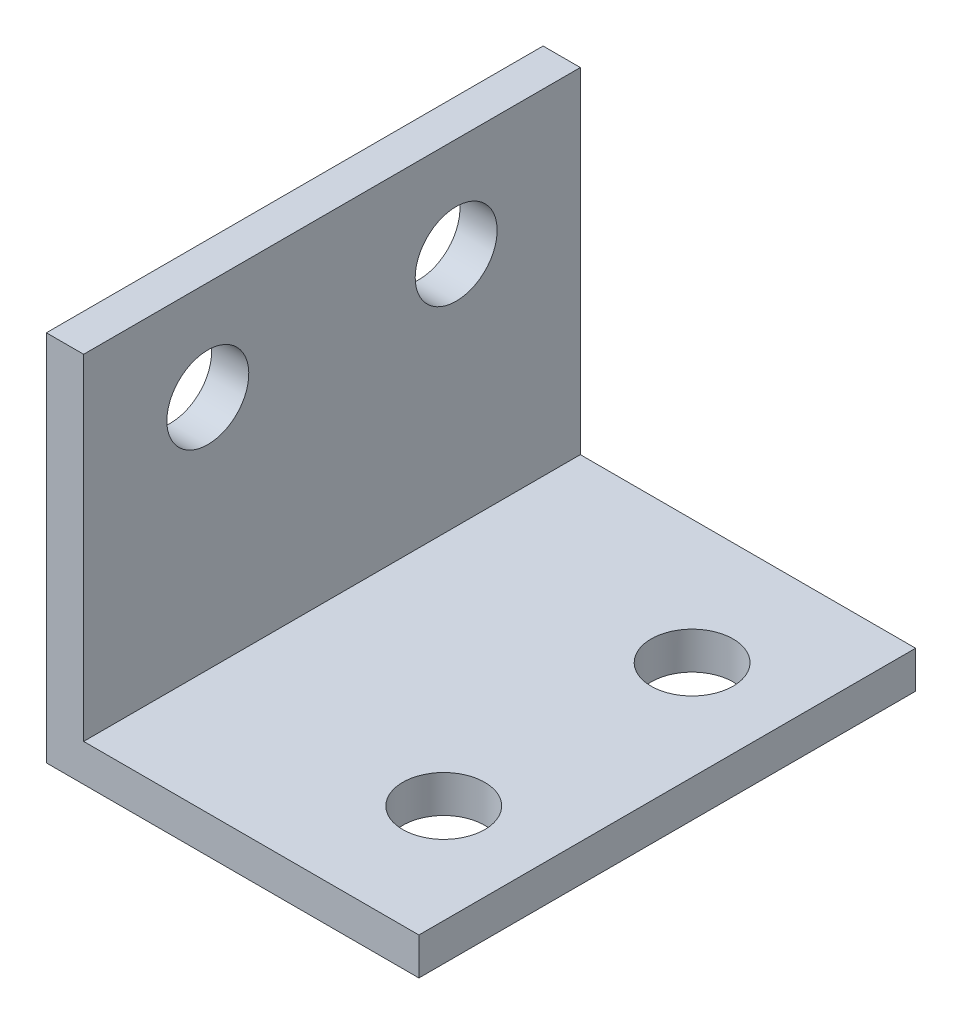
ISO-10303-21;
HEADER;
FILE_DESCRIPTION(('STEP AP214'),'2;1');
FILE_NAME('part.step','',(''),(''),'','','');
FILE_SCHEMA(('AUTOMOTIVE_DESIGN { 1 0 10303 214 1 1 1 1 }'));
ENDSEC;
DATA;
#1=APPLICATION_CONTEXT('core data for automotive mechanical design processes');
#2=APPLICATION_PROTOCOL_DEFINITION('international standard','automotive_design',2000,#1);
#3=PRODUCT_CONTEXT('',#1,'mechanical');
#4=PRODUCT('Part','Part','',(#3));
#5=PRODUCT_RELATED_PRODUCT_CATEGORY('part','',(#4));
#6=PRODUCT_DEFINITION_FORMATION('','',#4);
#7=PRODUCT_DEFINITION_CONTEXT('part definition',#1,'design');
#8=PRODUCT_DEFINITION('design','',#6,#7);
#9=PRODUCT_DEFINITION_SHAPE('','',#8);
#10=(LENGTH_UNIT() NAMED_UNIT(*) SI_UNIT(.MILLI.,.METRE.));
#11=(NAMED_UNIT(*) PLANE_ANGLE_UNIT() SI_UNIT($,.RADIAN.));
#12=(NAMED_UNIT(*) SI_UNIT($,.STERADIAN.) SOLID_ANGLE_UNIT());
#13=UNCERTAINTY_MEASURE_WITH_UNIT(LENGTH_MEASURE(1.E-05),#10,'distance_accuracy_value','');
#14=(GEOMETRIC_REPRESENTATION_CONTEXT(3) GLOBAL_UNCERTAINTY_ASSIGNED_CONTEXT((#13)) GLOBAL_UNIT_ASSIGNED_CONTEXT((#10,
#11,#12)) REPRESENTATION_CONTEXT('',''));
#15=CARTESIAN_POINT('',(0.,0.,0.));
#16=DIRECTION('',(0.,0.,1.));
#17=DIRECTION('',(1.,0.,0.));
#18=AXIS2_PLACEMENT_3D('',#15,#16,#17);
#19=CARTESIAN_POINT('',(30.,0.,40.));
#20=DIRECTION('',(0.,1.,0.));
#21=DIRECTION('',(-1.,0.,0.));
#22=AXIS2_PLACEMENT_3D('',#19,#20,#21);
#23=PLANE('',#22);
#24=CARTESIAN_POINT('',(22.,0.,10.));
#25=DIRECTION('',(0.,-1.,0.));
#26=DIRECTION('',(-1.,0.,0.));
#27=AXIS2_PLACEMENT_3D('',#24,#25,#26);
#28=CIRCLE('',#27,3.3);
#29=CARTESIAN_POINT('',(18.7,0.,10.));
#30=VERTEX_POINT('',#29);
#31=EDGE_CURVE('E150',#30,#30,#28,.T.);
#32=ORIENTED_EDGE('',*,*,#31,.F.);
#33=EDGE_LOOP('',(#32));
#34=FACE_BOUND('',#33,.T.);
#35=CARTESIAN_POINT('',(22.,0.,30.));
#36=DIRECTION('',(0.,-1.,0.));
#37=DIRECTION('',(1.,0.,0.));
#38=AXIS2_PLACEMENT_3D('',#35,#36,#37);
#39=CIRCLE('',#38,3.3);
#40=CARTESIAN_POINT('',(25.3,0.,30.));
#41=VERTEX_POINT('',#40);
#42=EDGE_CURVE('E139',#41,#41,#39,.T.);
#43=ORIENTED_EDGE('',*,*,#42,.F.);
#44=EDGE_LOOP('',(#43));
#45=FACE_BOUND('',#44,.T.);
#46=DIRECTION('',(1.,0.,0.));
#47=VECTOR('',#46,1.);
#48=CARTESIAN_POINT('',(30.,0.,0.));
#49=LINE('',#48,#47);
#50=CARTESIAN_POINT('',(0.,0.,0.));
#51=VERTEX_POINT('',#50);
#52=CARTESIAN_POINT('',(30.,0.,0.));
#53=VERTEX_POINT('',#52);
#54=EDGE_CURVE('E120',#51,#53,#49,.T.);
#55=ORIENTED_EDGE('',*,*,#54,.T.);
#56=DIRECTION('',(0.,0.,-1.));
#57=VECTOR('',#56,1.);
#58=CARTESIAN_POINT('',(30.,0.,40.));
#59=LINE('',#58,#57);
#60=CARTESIAN_POINT('',(30.,0.,40.));
#61=VERTEX_POINT('',#60);
#62=EDGE_CURVE('E11',#61,#53,#59,.T.);
#63=ORIENTED_EDGE('',*,*,#62,.F.);
#64=DIRECTION('',(1.,0.,0.));
#65=VECTOR('',#64,1.);
#66=CARTESIAN_POINT('',(30.,0.,40.));
#67=LINE('',#66,#65);
#68=CARTESIAN_POINT('',(0.,0.,40.));
#69=VERTEX_POINT('',#68);
#70=EDGE_CURVE('E131',#69,#61,#67,.T.);
#71=ORIENTED_EDGE('',*,*,#70,.F.);
#72=DIRECTION('',(0.,0.,-1.));
#73=VECTOR('',#72,1.);
#74=CARTESIAN_POINT('',(0.,0.,40.));
#75=LINE('',#74,#73);
#76=EDGE_CURVE('E116',#69,#51,#75,.T.);
#77=ORIENTED_EDGE('',*,*,#76,.T.);
#78=EDGE_LOOP('',(#55,#63,#71,#77));
#79=FACE_BOUND('',#78,.T.);
#80=ADVANCED_FACE('F34',(#34,#45,#79),#23,.F.);
#81=CARTESIAN_POINT('',(30.,3.,40.));
#82=DIRECTION('',(-1.,0.,0.));
#83=DIRECTION('',(0.,0.,1.));
#84=AXIS2_PLACEMENT_3D('',#81,#82,#83);
#85=PLANE('',#84);
#86=DIRECTION('',(0.,1.,0.));
#87=VECTOR('',#86,1.);
#88=CARTESIAN_POINT('',(30.,3.,0.));
#89=LINE('',#88,#87);
#90=CARTESIAN_POINT('',(30.,3.,0.));
#91=VERTEX_POINT('',#90);
#92=EDGE_CURVE('E123',#53,#91,#89,.T.);
#93=ORIENTED_EDGE('',*,*,#92,.T.);
#94=DIRECTION('',(0.,0.,-1.));
#95=VECTOR('',#94,1.);
#96=CARTESIAN_POINT('',(30.,3.,40.));
#97=LINE('',#96,#95);
#98=CARTESIAN_POINT('',(30.,3.,40.));
#99=VERTEX_POINT('',#98);
#100=EDGE_CURVE('E43',#99,#91,#97,.T.);
#101=ORIENTED_EDGE('',*,*,#100,.F.);
#102=DIRECTION('',(0.,1.,0.));
#103=VECTOR('',#102,1.);
#104=CARTESIAN_POINT('',(30.,3.,40.));
#105=LINE('',#104,#103);
#106=EDGE_CURVE('E89',#61,#99,#105,.T.);
#107=ORIENTED_EDGE('',*,*,#106,.F.);
#108=ORIENTED_EDGE('',*,*,#62,.T.);
#109=EDGE_LOOP('',(#93,#101,#107,#108));
#110=FACE_BOUND('',#109,.T.);
#111=ADVANCED_FACE('F163',(#110),#85,.F.);
#112=CARTESIAN_POINT('',(3.,3.,40.));
#113=DIRECTION('',(0.,-1.,0.));
#114=DIRECTION('',(1.,0.,0.));
#115=AXIS2_PLACEMENT_3D('',#112,#113,#114);
#116=PLANE('',#115);
#117=CARTESIAN_POINT('',(22.,3.,10.));
#118=DIRECTION('',(0.,-1.,0.));
#119=DIRECTION('',(1.,0.,0.));
#120=AXIS2_PLACEMENT_3D('',#117,#118,#119);
#121=CIRCLE('',#120,3.3);
#122=CARTESIAN_POINT('',(25.3,3.,10.));
#123=VERTEX_POINT('',#122);
#124=EDGE_CURVE('E37',#123,#123,#121,.T.);
#125=ORIENTED_EDGE('',*,*,#124,.T.);
#126=EDGE_LOOP('',(#125));
#127=FACE_BOUND('',#126,.T.);
#128=CARTESIAN_POINT('',(22.,3.,30.));
#129=DIRECTION('',(0.,-1.,0.));
#130=DIRECTION('',(1.,0.,0.));
#131=AXIS2_PLACEMENT_3D('',#128,#129,#130);
#132=CIRCLE('',#131,3.3);
#133=CARTESIAN_POINT('',(25.3,3.,30.));
#134=VERTEX_POINT('',#133);
#135=EDGE_CURVE('E136',#134,#134,#132,.T.);
#136=ORIENTED_EDGE('',*,*,#135,.T.);
#137=EDGE_LOOP('',(#136));
#138=FACE_BOUND('',#137,.T.);
#139=DIRECTION('',(-1.,0.,0.));
#140=VECTOR('',#139,1.);
#141=CARTESIAN_POINT('',(3.,3.,0.));
#142=LINE('',#141,#140);
#143=CARTESIAN_POINT('',(3.,3.,0.));
#144=VERTEX_POINT('',#143);
#145=EDGE_CURVE('E126',#91,#144,#142,.T.);
#146=ORIENTED_EDGE('',*,*,#145,.T.);
#147=DIRECTION('',(0.,0.,-1.));
#148=VECTOR('',#147,1.);
#149=CARTESIAN_POINT('',(3.,3.,40.));
#150=LINE('',#149,#148);
#151=CARTESIAN_POINT('',(3.,3.,40.));
#152=VERTEX_POINT('',#151);
#153=EDGE_CURVE('E111',#152,#144,#150,.T.);
#154=ORIENTED_EDGE('',*,*,#153,.F.);
#155=DIRECTION('',(-1.,0.,0.));
#156=VECTOR('',#155,1.);
#157=CARTESIAN_POINT('',(3.,3.,40.));
#158=LINE('',#157,#156);
#159=EDGE_CURVE('E102',#99,#152,#158,.T.);
#160=ORIENTED_EDGE('',*,*,#159,.F.);
#161=ORIENTED_EDGE('',*,*,#100,.T.);
#162=EDGE_LOOP('',(#146,#154,#160,#161));
#163=FACE_BOUND('',#162,.T.);
#164=ADVANCED_FACE('F166',(#127,#138,#163),#116,.F.);
#165=CARTESIAN_POINT('',(3.,30.,40.));
#166=DIRECTION('',(-1.,0.,0.));
#167=DIRECTION('',(0.,-1.,0.));
#168=AXIS2_PLACEMENT_3D('',#165,#166,#167);
#169=PLANE('',#168);
#170=CARTESIAN_POINT('',(3.,22.,30.));
#171=DIRECTION('',(-1.,0.,0.));
#172=DIRECTION('',(0.,-1.,0.));
#173=AXIS2_PLACEMENT_3D('',#170,#171,#172);
#174=CIRCLE('',#173,3.30000000000001);
#175=CARTESIAN_POINT('',(3.,18.7,30.));
#176=VERTEX_POINT('',#175);
#177=EDGE_CURVE('E143',#176,#176,#174,.T.);
#178=ORIENTED_EDGE('',*,*,#177,.T.);
#179=EDGE_LOOP('',(#178));
#180=FACE_BOUND('',#179,.T.);
#181=CARTESIAN_POINT('',(3.,22.,10.));
#182=DIRECTION('',(-1.,0.,0.));
#183=DIRECTION('',(0.,-1.,0.));
#184=AXIS2_PLACEMENT_3D('',#181,#182,#183);
#185=CIRCLE('',#184,3.3);
#186=CARTESIAN_POINT('',(3.,18.7,10.));
#187=VERTEX_POINT('',#186);
#188=EDGE_CURVE('E124',#187,#187,#185,.T.);
#189=ORIENTED_EDGE('',*,*,#188,.T.);
#190=EDGE_LOOP('',(#189));
#191=FACE_BOUND('',#190,.T.);
#192=DIRECTION('',(0.,1.,0.));
#193=VECTOR('',#192,1.);
#194=CARTESIAN_POINT('',(3.,30.,0.));
#195=LINE('',#194,#193);
#196=CARTESIAN_POINT('',(3.,30.,0.));
#197=VERTEX_POINT('',#196);
#198=EDGE_CURVE('E110',#144,#197,#195,.T.);
#199=ORIENTED_EDGE('',*,*,#198,.T.);
#200=DIRECTION('',(0.,0.,-1.));
#201=VECTOR('',#200,1.);
#202=CARTESIAN_POINT('',(3.,30.,40.));
#203=LINE('',#202,#201);
#204=CARTESIAN_POINT('',(3.,30.,40.));
#205=VERTEX_POINT('',#204);
#206=EDGE_CURVE('E107',#205,#197,#203,.T.);
#207=ORIENTED_EDGE('',*,*,#206,.F.);
#208=DIRECTION('',(0.,1.,0.));
#209=VECTOR('',#208,1.);
#210=CARTESIAN_POINT('',(3.,30.,40.));
#211=LINE('',#210,#209);
#212=EDGE_CURVE('E96',#152,#205,#211,.T.);
#213=ORIENTED_EDGE('',*,*,#212,.F.);
#214=ORIENTED_EDGE('',*,*,#153,.T.);
#215=EDGE_LOOP('',(#199,#207,#213,#214));
#216=FACE_BOUND('',#215,.T.);
#217=ADVANCED_FACE('F108',(#180,#191,#216),#169,.F.);
#218=CARTESIAN_POINT('',(0.,30.,40.));
#219=DIRECTION('',(0.,-1.,0.));
#220=DIRECTION('',(0.,0.,-1.));
#221=AXIS2_PLACEMENT_3D('',#218,#219,#220);
#222=PLANE('',#221);
#223=DIRECTION('',(-1.,0.,0.));
#224=VECTOR('',#223,1.);
#225=CARTESIAN_POINT('',(0.,30.,0.));
#226=LINE('',#225,#224);
#227=CARTESIAN_POINT('',(0.,30.,0.));
#228=VERTEX_POINT('',#227);
#229=EDGE_CURVE('E75',#197,#228,#226,.T.);
#230=ORIENTED_EDGE('',*,*,#229,.T.);
#231=DIRECTION('',(0.,0.,-1.));
#232=VECTOR('',#231,1.);
#233=CARTESIAN_POINT('',(0.,30.,40.));
#234=LINE('',#233,#232);
#235=CARTESIAN_POINT('',(0.,30.,40.));
#236=VERTEX_POINT('',#235);
#237=EDGE_CURVE('E112',#236,#228,#234,.T.);
#238=ORIENTED_EDGE('',*,*,#237,.F.);
#239=DIRECTION('',(-1.,0.,0.));
#240=VECTOR('',#239,1.);
#241=CARTESIAN_POINT('',(0.,30.,40.));
#242=LINE('',#241,#240);
#243=EDGE_CURVE('E100',#205,#236,#242,.T.);
#244=ORIENTED_EDGE('',*,*,#243,.F.);
#245=ORIENTED_EDGE('',*,*,#206,.T.);
#246=EDGE_LOOP('',(#230,#238,#244,#245));
#247=FACE_BOUND('',#246,.T.);
#248=ADVANCED_FACE('F114',(#247),#222,.F.);
#249=CARTESIAN_POINT('',(0.,0.,40.));
#250=DIRECTION('',(1.,0.,0.));
#251=DIRECTION('',(0.,0.,-1.));
#252=AXIS2_PLACEMENT_3D('',#249,#250,#251);
#253=PLANE('',#252);
#254=CARTESIAN_POINT('',(0.,22.,30.));
#255=DIRECTION('',(-1.,0.,0.));
#256=DIRECTION('',(0.,0.,-1.));
#257=AXIS2_PLACEMENT_3D('',#254,#255,#256);
#258=CIRCLE('',#257,3.30000000000001);
#259=CARTESIAN_POINT('',(0.,22.,26.7));
#260=VERTEX_POINT('',#259);
#261=EDGE_CURVE('E138',#260,#260,#258,.T.);
#262=ORIENTED_EDGE('',*,*,#261,.F.);
#263=EDGE_LOOP('',(#262));
#264=FACE_BOUND('',#263,.T.);
#265=CARTESIAN_POINT('',(0.,22.,10.));
#266=DIRECTION('',(-1.,0.,0.));
#267=DIRECTION('',(0.,0.,1.));
#268=AXIS2_PLACEMENT_3D('',#265,#266,#267);
#269=CIRCLE('',#268,3.3);
#270=CARTESIAN_POINT('',(0.,22.,13.3));
#271=VERTEX_POINT('',#270);
#272=EDGE_CURVE('E155',#271,#271,#269,.T.);
#273=ORIENTED_EDGE('',*,*,#272,.F.);
#274=EDGE_LOOP('',(#273));
#275=FACE_BOUND('',#274,.T.);
#276=DIRECTION('',(0.,-1.,0.));
#277=VECTOR('',#276,1.);
#278=CARTESIAN_POINT('',(0.,0.,0.));
#279=LINE('',#278,#277);
#280=EDGE_CURVE('E81',#228,#51,#279,.T.);
#281=ORIENTED_EDGE('',*,*,#280,.T.);
#282=ORIENTED_EDGE('',*,*,#76,.F.);
#283=DIRECTION('',(0.,-1.,0.));
#284=VECTOR('',#283,1.);
#285=CARTESIAN_POINT('',(0.,0.,40.));
#286=LINE('',#285,#284);
#287=EDGE_CURVE('E52',#236,#69,#286,.T.);
#288=ORIENTED_EDGE('',*,*,#287,.F.);
#289=ORIENTED_EDGE('',*,*,#237,.T.);
#290=EDGE_LOOP('',(#281,#282,#288,#289));
#291=FACE_BOUND('',#290,.T.);
#292=ADVANCED_FACE('F171',(#264,#275,#291),#253,.F.);
#293=CARTESIAN_POINT('',(0.,0.,40.));
#294=DIRECTION('',(0.,0.,-1.));
#295=DIRECTION('',(-1.,0.,0.));
#296=AXIS2_PLACEMENT_3D('',#293,#294,#295);
#297=PLANE('',#296);
#298=ORIENTED_EDGE('',*,*,#70,.T.);
#299=ORIENTED_EDGE('',*,*,#106,.T.);
#300=ORIENTED_EDGE('',*,*,#159,.T.);
#301=ORIENTED_EDGE('',*,*,#212,.T.);
#302=ORIENTED_EDGE('',*,*,#243,.T.);
#303=ORIENTED_EDGE('',*,*,#287,.T.);
#304=EDGE_LOOP('',(#298,#299,#300,#301,#302,#303));
#305=FACE_BOUND('',#304,.T.);
#306=ADVANCED_FACE('F98',(#305),#297,.F.);
#307=CARTESIAN_POINT('',(0.,0.,0.));
#308=DIRECTION('',(0.,0.,-1.));
#309=DIRECTION('',(-1.,0.,0.));
#310=AXIS2_PLACEMENT_3D('',#307,#308,#309);
#311=PLANE('',#310);
#312=ORIENTED_EDGE('',*,*,#54,.F.);
#313=ORIENTED_EDGE('',*,*,#280,.F.);
#314=ORIENTED_EDGE('',*,*,#229,.F.);
#315=ORIENTED_EDGE('',*,*,#198,.F.);
#316=ORIENTED_EDGE('',*,*,#145,.F.);
#317=ORIENTED_EDGE('',*,*,#92,.F.);
#318=EDGE_LOOP('',(#312,#313,#314,#315,#316,#317));
#319=FACE_BOUND('',#318,.T.);
#320=ADVANCED_FACE('F169',(#319),#311,.T.);
#321=CARTESIAN_POINT('',(40.,22.,10.));
#322=DIRECTION('',(-1.,0.,0.));
#323=DIRECTION('',(0.,0.,1.));
#324=AXIS2_PLACEMENT_3D('',#321,#322,#323);
#325=CYLINDRICAL_SURFACE('',#324,3.3);
#326=ORIENTED_EDGE('',*,*,#272,.T.);
#327=EDGE_LOOP('',(#326));
#328=FACE_BOUND('',#327,.T.);
#329=ORIENTED_EDGE('',*,*,#188,.F.);
#330=EDGE_LOOP('',(#329));
#331=FACE_BOUND('',#330,.T.);
#332=ADVANCED_FACE('F213',(#328,#331),#325,.F.);
#333=CARTESIAN_POINT('',(40.,22.,30.));
#334=DIRECTION('',(-1.,0.,0.));
#335=DIRECTION('',(0.,0.,1.));
#336=AXIS2_PLACEMENT_3D('',#333,#334,#335);
#337=CYLINDRICAL_SURFACE('',#336,3.30000000000001);
#338=ORIENTED_EDGE('',*,*,#261,.T.);
#339=EDGE_LOOP('',(#338));
#340=FACE_BOUND('',#339,.T.);
#341=ORIENTED_EDGE('',*,*,#177,.F.);
#342=EDGE_LOOP('',(#341));
#343=FACE_BOUND('',#342,.T.);
#344=ADVANCED_FACE('F215',(#340,#343),#337,.F.);
#345=CARTESIAN_POINT('',(22.,40.,30.));
#346=DIRECTION('',(0.,-1.,0.));
#347=DIRECTION('',(1.,0.,0.));
#348=AXIS2_PLACEMENT_3D('',#345,#346,#347);
#349=CYLINDRICAL_SURFACE('',#348,3.3);
#350=ORIENTED_EDGE('',*,*,#42,.T.);
#351=EDGE_LOOP('',(#350));
#352=FACE_BOUND('',#351,.T.);
#353=ORIENTED_EDGE('',*,*,#135,.F.);
#354=EDGE_LOOP('',(#353));
#355=FACE_BOUND('',#354,.T.);
#356=ADVANCED_FACE('F196',(#352,#355),#349,.F.);
#357=CARTESIAN_POINT('',(22.,40.,10.));
#358=DIRECTION('',(0.,-1.,0.));
#359=DIRECTION('',(1.,0.,0.));
#360=AXIS2_PLACEMENT_3D('',#357,#358,#359);
#361=CYLINDRICAL_SURFACE('',#360,3.3);
#362=ORIENTED_EDGE('',*,*,#31,.T.);
#363=EDGE_LOOP('',(#362));
#364=FACE_BOUND('',#363,.T.);
#365=ORIENTED_EDGE('',*,*,#124,.F.);
#366=EDGE_LOOP('',(#365));
#367=FACE_BOUND('',#366,.T.);
#368=ADVANCED_FACE('F193',(#364,#367),#361,.F.);
#369=CLOSED_SHELL('',(#80,#111,#164,#217,#248,#292,#306,#320,#332,#344,#356,#368));
#370=MANIFOLD_SOLID_BREP('B2',#369);
#371=ADVANCED_BREP_SHAPE_REPRESENTATION('',(#18,#370),#14);
#372=SHAPE_DEFINITION_REPRESENTATION(#9,#371);
ENDSEC;
END-ISO-10303-21;
